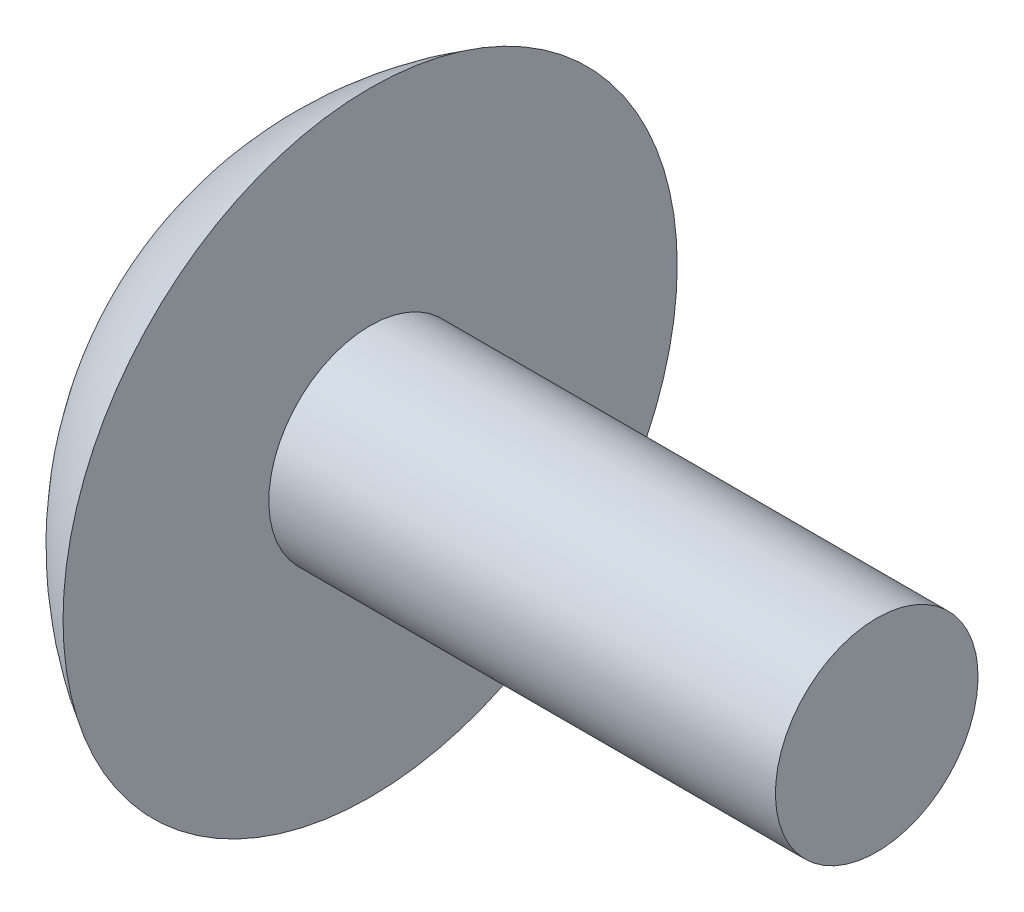
ISO-10303-21;
HEADER;
FILE_DESCRIPTION(('STEP AP214'),'2;1');
FILE_NAME('part.step','',(''),(''),'','','');
FILE_SCHEMA(('AUTOMOTIVE_DESIGN { 1 0 10303 214 1 1 1 1 }'));
ENDSEC;
DATA;
#1=APPLICATION_CONTEXT('core data for automotive mechanical design processes');
#2=APPLICATION_PROTOCOL_DEFINITION('international standard','automotive_design',2000,#1);
#3=PRODUCT_CONTEXT('',#1,'mechanical');
#4=PRODUCT('Part','Part','',(#3));
#5=PRODUCT_RELATED_PRODUCT_CATEGORY('part','',(#4));
#6=PRODUCT_DEFINITION_FORMATION('','',#4);
#7=PRODUCT_DEFINITION_CONTEXT('part definition',#1,'design');
#8=PRODUCT_DEFINITION('design','',#6,#7);
#9=PRODUCT_DEFINITION_SHAPE('','',#8);
#10=(LENGTH_UNIT() NAMED_UNIT(*) SI_UNIT(.MILLI.,.METRE.));
#11=(NAMED_UNIT(*) PLANE_ANGLE_UNIT() SI_UNIT($,.RADIAN.));
#12=(NAMED_UNIT(*) SI_UNIT($,.STERADIAN.) SOLID_ANGLE_UNIT());
#13=UNCERTAINTY_MEASURE_WITH_UNIT(LENGTH_MEASURE(1.E-05),#10,'distance_accuracy_value','');
#14=(GEOMETRIC_REPRESENTATION_CONTEXT(3) GLOBAL_UNCERTAINTY_ASSIGNED_CONTEXT((#13)) GLOBAL_UNIT_ASSIGNED_CONTEXT((#10,
#11,#12)) REPRESENTATION_CONTEXT('',''));
#15=CARTESIAN_POINT('',(0.,0.,0.));
#16=DIRECTION('',(0.,0.,1.));
#17=DIRECTION('',(1.,0.,0.));
#18=AXIS2_PLACEMENT_3D('',#15,#16,#17);
#19=CARTESIAN_POINT('',(0.,0.,0.));
#20=DIRECTION('',(-1.,0.,0.));
#21=DIRECTION('',(0.,-1.,0.));
#22=AXIS2_PLACEMENT_3D('',#19,#20,#21);
#23=PLANE('',#22);
#24=CARTESIAN_POINT('',(0.,0.,0.));
#25=DIRECTION('',(1.,0.,0.));
#26=DIRECTION('',(0.,1.,0.));
#27=AXIS2_PLACEMENT_3D('',#24,#25,#26);
#28=CIRCLE('',#27,2.);
#29=CARTESIAN_POINT('',(0.,2.,0.));
#30=VERTEX_POINT('',#29);
#31=EDGE_CURVE('E41',#30,#30,#28,.T.);
#32=ORIENTED_EDGE('',*,*,#31,.T.);
#33=EDGE_LOOP('',(#32));
#34=FACE_BOUND('',#33,.T.);
#35=ADVANCED_FACE('F31',(#34),#23,.F.);
#36=CARTESIAN_POINT('',(-6.5,0.,0.));
#37=DIRECTION('',(1.,0.,0.));
#38=DIRECTION('',(0.,-1.,0.));
#39=AXIS2_PLACEMENT_3D('',#36,#37,#38);
#40=SPHERICAL_SURFACE('',#39,7.);
#41=CARTESIAN_POINT('',(-10.,0.,0.));
#42=DIRECTION('',(1.,0.,0.));
#43=DIRECTION('',(0.,1.,0.));
#44=AXIS2_PLACEMENT_3D('',#41,#42,#43);
#45=CIRCLE('',#44,6.06217782649107);
#46=CARTESIAN_POINT('',(-10.,6.06217782649107,0.));
#47=VERTEX_POINT('',#46);
#48=EDGE_CURVE('E10',#47,#47,#45,.T.);
#49=ORIENTED_EDGE('',*,*,#48,.F.);
#50=EDGE_LOOP('',(#49));
#51=FACE_BOUND('',#50,.T.);
#52=ADVANCED_FACE('F56',(#51),#40,.T.);
#53=CARTESIAN_POINT('',(-10.,-2.,0.));
#54=DIRECTION('',(-1.,0.,0.));
#55=DIRECTION('',(0.,-1.,0.));
#56=AXIS2_PLACEMENT_3D('',#53,#54,#55);
#57=PLANE('',#56);
#58=CARTESIAN_POINT('',(-10.,0.,0.));
#59=DIRECTION('',(1.,0.,0.));
#60=DIRECTION('',(0.,1.,0.));
#61=AXIS2_PLACEMENT_3D('',#58,#59,#60);
#62=CIRCLE('',#61,2.);
#63=CARTESIAN_POINT('',(-10.,2.,0.));
#64=VERTEX_POINT('',#63);
#65=EDGE_CURVE('E37',#64,#64,#62,.T.);
#66=ORIENTED_EDGE('',*,*,#65,.F.);
#67=EDGE_LOOP('',(#66));
#68=FACE_BOUND('',#67,.T.);
#69=ORIENTED_EDGE('',*,*,#48,.T.);
#70=EDGE_LOOP('',(#69));
#71=FACE_BOUND('',#70,.T.);
#72=ADVANCED_FACE('F51',(#68,#71),#57,.F.);
#73=CARTESIAN_POINT('',(0.,0.,0.));
#74=DIRECTION('',(1.,0.,0.));
#75=DIRECTION('',(0.,1.,0.));
#76=AXIS2_PLACEMENT_3D('',#73,#74,#75);
#77=CYLINDRICAL_SURFACE('',#76,2.);
#78=ORIENTED_EDGE('',*,*,#31,.F.);
#79=EDGE_LOOP('',(#78));
#80=FACE_BOUND('',#79,.T.);
#81=ORIENTED_EDGE('',*,*,#65,.T.);
#82=EDGE_LOOP('',(#81));
#83=FACE_BOUND('',#82,.T.);
#84=ADVANCED_FACE('F49',(#80,#83),#77,.T.);
#85=CLOSED_SHELL('',(#35,#52,#72,#84));
#86=MANIFOLD_SOLID_BREP('B2',#85);
#87=ADVANCED_BREP_SHAPE_REPRESENTATION('',(#18,#86),#14);
#88=SHAPE_DEFINITION_REPRESENTATION(#9,#87);
ENDSEC;
END-ISO-10303-21;
